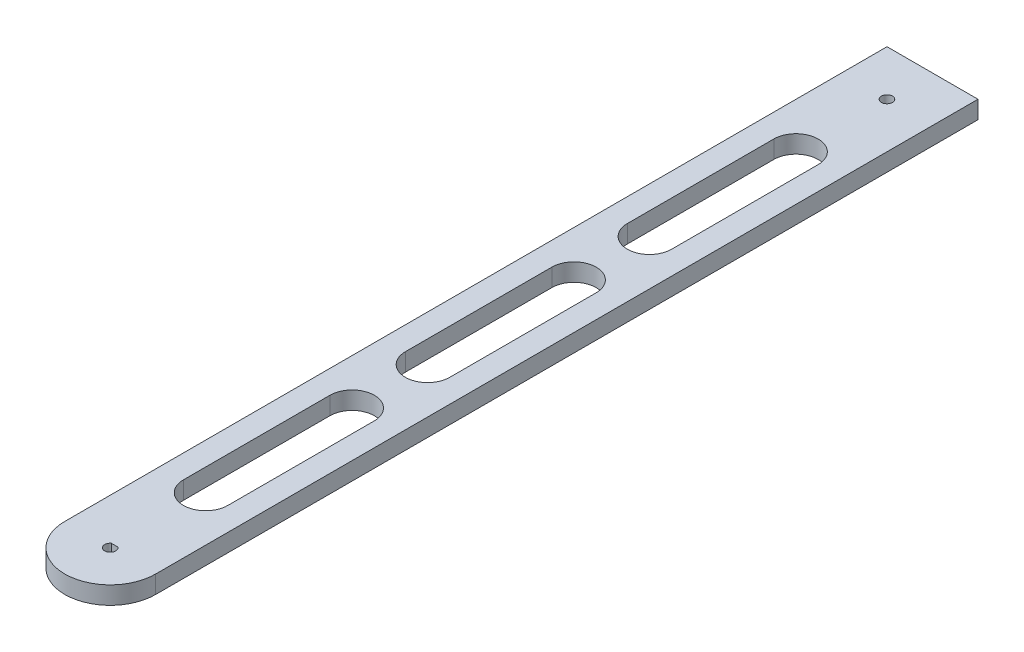
ISO-10303-21;
HEADER;
FILE_DESCRIPTION(('STEP AP214'),'2;1');
FILE_NAME('part.step','',(''),(''),'','','');
FILE_SCHEMA(('AUTOMOTIVE_DESIGN { 1 0 10303 214 1 1 1 1 }'));
ENDSEC;
DATA;
#1=APPLICATION_CONTEXT('core data for automotive mechanical design processes');
#2=APPLICATION_PROTOCOL_DEFINITION('international standard','automotive_design',2000,#1);
#3=PRODUCT_CONTEXT('',#1,'mechanical');
#4=PRODUCT('Part','Part','',(#3));
#5=PRODUCT_RELATED_PRODUCT_CATEGORY('part','',(#4));
#6=PRODUCT_DEFINITION_FORMATION('','',#4);
#7=PRODUCT_DEFINITION_CONTEXT('part definition',#1,'design');
#8=PRODUCT_DEFINITION('design','',#6,#7);
#9=PRODUCT_DEFINITION_SHAPE('','',#8);
#10=(LENGTH_UNIT() NAMED_UNIT(*) SI_UNIT(.MILLI.,.METRE.));
#11=(NAMED_UNIT(*) PLANE_ANGLE_UNIT() SI_UNIT($,.RADIAN.));
#12=(NAMED_UNIT(*) SI_UNIT($,.STERADIAN.) SOLID_ANGLE_UNIT());
#13=UNCERTAINTY_MEASURE_WITH_UNIT(LENGTH_MEASURE(1.E-05),#10,'distance_accuracy_value','');
#14=(GEOMETRIC_REPRESENTATION_CONTEXT(3) GLOBAL_UNCERTAINTY_ASSIGNED_CONTEXT((#13)) GLOBAL_UNIT_ASSIGNED_CONTEXT((#10,
#11,#12)) REPRESENTATION_CONTEXT('',''));
#15=CARTESIAN_POINT('',(0.,0.,0.));
#16=DIRECTION('',(0.,0.,1.));
#17=DIRECTION('',(1.,0.,0.));
#18=AXIS2_PLACEMENT_3D('',#15,#16,#17);
#19=CARTESIAN_POINT('',(0.,29.1,-21.6));
#20=DIRECTION('',(0.,1.,0.));
#21=DIRECTION('',(0.,0.,1.));
#22=AXIS2_PLACEMENT_3D('',#19,#20,#21);
#23=PLANE('',#22);
#24=CARTESIAN_POINT('',(0.,29.1,-371.6));
#25=DIRECTION('',(0.,1.,0.));
#26=DIRECTION('',(0.,0.,1.));
#27=AXIS2_PLACEMENT_3D('',#24,#25,#26);
#28=CIRCLE('',#27,2.5);
#29=CARTESIAN_POINT('',(0.,29.1,-369.1));
#30=VERTEX_POINT('',#29);
#31=EDGE_CURVE('E202',#30,#30,#28,.F.);
#32=ORIENTED_EDGE('',*,*,#31,.T.);
#33=EDGE_LOOP('',(#32));
#34=FACE_BOUND('',#33,.T.);
#35=DIRECTION('',(-1.,0.,0.));
#36=VECTOR('',#35,1.);
#37=CARTESIAN_POINT('',(-20.5,29.1,-392.131331168693));
#38=LINE('',#37,#36);
#39=CARTESIAN_POINT('',(20.5,29.1,-392.131331168693));
#40=VERTEX_POINT('',#39);
#41=CARTESIAN_POINT('',(-20.5,29.1,-392.131331168693));
#42=VERTEX_POINT('',#41);
#43=EDGE_CURVE('E163',#40,#42,#38,.T.);
#44=ORIENTED_EDGE('',*,*,#43,.T.);
#45=DIRECTION('',(0.,0.,1.));
#46=VECTOR('',#45,1.);
#47=CARTESIAN_POINT('',(-20.5,29.1,-21.6));
#48=LINE('',#47,#46);
#49=CARTESIAN_POINT('',(-20.5,29.1,-21.6));
#50=VERTEX_POINT('',#49);
#51=EDGE_CURVE('E168',#42,#50,#48,.T.);
#52=ORIENTED_EDGE('',*,*,#51,.T.);
#53=CARTESIAN_POINT('',(0.,29.1,-21.6));
#54=DIRECTION('',(0.,1.,0.));
#55=DIRECTION('',(0.,0.,1.));
#56=AXIS2_PLACEMENT_3D('',#53,#54,#55);
#57=CIRCLE('',#56,20.5);
#58=CARTESIAN_POINT('',(20.5,29.1,-21.6));
#59=VERTEX_POINT('',#58);
#60=EDGE_CURVE('E165',#50,#59,#57,.T.);
#61=ORIENTED_EDGE('',*,*,#60,.T.);
#62=DIRECTION('',(0.,0.,-1.));
#63=VECTOR('',#62,1.);
#64=CARTESIAN_POINT('',(20.5,29.1,-21.6));
#65=LINE('',#64,#63);
#66=EDGE_CURVE('E159',#59,#40,#65,.T.);
#67=ORIENTED_EDGE('',*,*,#66,.T.);
#68=EDGE_LOOP('',(#44,#52,#61,#67));
#69=FACE_BOUND('',#68,.T.);
#70=CARTESIAN_POINT('',(0.,29.1,-21.6));
#71=DIRECTION('',(0.,1.,0.));
#72=DIRECTION('',(0.,0.,1.));
#73=AXIS2_PLACEMENT_3D('',#70,#71,#72);
#74=CIRCLE('',#73,2.5);
#75=CARTESIAN_POINT('',(-1.5,29.1,-23.6));
#76=VERTEX_POINT('',#75);
#77=CARTESIAN_POINT('',(1.5,29.1,-23.6));
#78=VERTEX_POINT('',#77);
#79=EDGE_CURVE('E190',#76,#78,#74,.T.);
#80=ORIENTED_EDGE('',*,*,#79,.F.);
#81=DIRECTION('',(1.,0.,0.));
#82=VECTOR('',#81,1.);
#83=CARTESIAN_POINT('',(0.,29.1,-23.6));
#84=LINE('',#83,#82);
#85=EDGE_CURVE('E48',#76,#78,#84,.T.);
#86=ORIENTED_EDGE('',*,*,#85,.T.);
#87=EDGE_LOOP('',(#80,#86));
#88=FACE_BOUND('',#87,.T.);
#89=DIRECTION('',(0.,0.,1.));
#90=VECTOR('',#89,1.);
#91=CARTESIAN_POINT('',(-9.99999999999999,29.1,-330.6));
#92=LINE('',#91,#90);
#93=CARTESIAN_POINT('',(-9.99999999999999,29.1,-330.6));
#94=VERTEX_POINT('',#93);
#95=CARTESIAN_POINT('',(-9.99999999999998,29.1,-264.6));
#96=VERTEX_POINT('',#95);
#97=EDGE_CURVE('E269',#94,#96,#92,.T.);
#98=ORIENTED_EDGE('',*,*,#97,.F.);
#99=CARTESIAN_POINT('',(0.,29.1,-330.6));
#100=DIRECTION('',(0.,1.,0.));
#101=DIRECTION('',(0.,0.,1.));
#102=AXIS2_PLACEMENT_3D('',#99,#100,#101);
#103=CIRCLE('',#102,10.);
#104=CARTESIAN_POINT('',(10.,29.1,-330.6));
#105=VERTEX_POINT('',#104);
#106=EDGE_CURVE('E267',#105,#94,#103,.T.);
#107=ORIENTED_EDGE('',*,*,#106,.F.);
#108=DIRECTION('',(0.,0.,-1.));
#109=VECTOR('',#108,1.);
#110=CARTESIAN_POINT('',(10.,29.1,-330.6));
#111=LINE('',#110,#109);
#112=CARTESIAN_POINT('',(10.,29.1,-264.6));
#113=VERTEX_POINT('',#112);
#114=EDGE_CURVE('E275',#113,#105,#111,.T.);
#115=ORIENTED_EDGE('',*,*,#114,.F.);
#116=CARTESIAN_POINT('',(0.,29.1,-264.6));
#117=DIRECTION('',(0.,1.,0.));
#118=DIRECTION('',(0.,0.,1.));
#119=AXIS2_PLACEMENT_3D('',#116,#117,#118);
#120=CIRCLE('',#119,10.);
#121=EDGE_CURVE('E272',#96,#113,#120,.T.);
#122=ORIENTED_EDGE('',*,*,#121,.F.);
#123=EDGE_LOOP('',(#98,#107,#115,#122));
#124=FACE_BOUND('',#123,.T.);
#125=DIRECTION('',(0.,0.,1.));
#126=VECTOR('',#125,1.);
#127=CARTESIAN_POINT('',(-9.99999999999895,29.1,-230.6));
#128=LINE('',#127,#126);
#129=CARTESIAN_POINT('',(-9.99999999999895,29.1,-230.6));
#130=VERTEX_POINT('',#129);
#131=CARTESIAN_POINT('',(-9.99999999999894,29.1,-164.6));
#132=VERTEX_POINT('',#131);
#133=EDGE_CURVE('E238',#130,#132,#128,.T.);
#134=ORIENTED_EDGE('',*,*,#133,.F.);
#135=CARTESIAN_POINT('',(1.05178573957986E-12,29.1,-230.6));
#136=DIRECTION('',(0.,1.,0.));
#137=DIRECTION('',(0.,0.,1.));
#138=AXIS2_PLACEMENT_3D('',#135,#136,#137);
#139=CIRCLE('',#138,10.);
#140=CARTESIAN_POINT('',(10.0000000000011,29.1,-230.6));
#141=VERTEX_POINT('',#140);
#142=EDGE_CURVE('E236',#141,#130,#139,.T.);
#143=ORIENTED_EDGE('',*,*,#142,.F.);
#144=DIRECTION('',(0.,0.,-1.));
#145=VECTOR('',#144,1.);
#146=CARTESIAN_POINT('',(10.0000000000011,29.1,-230.6));
#147=LINE('',#146,#145);
#148=CARTESIAN_POINT('',(10.0000000000011,29.1,-164.6));
#149=VERTEX_POINT('',#148);
#150=EDGE_CURVE('E244',#149,#141,#147,.T.);
#151=ORIENTED_EDGE('',*,*,#150,.F.);
#152=CARTESIAN_POINT('',(1.05986840845423E-12,29.1,-164.6));
#153=DIRECTION('',(0.,1.,0.));
#154=DIRECTION('',(0.,0.,1.));
#155=AXIS2_PLACEMENT_3D('',#152,#153,#154);
#156=CIRCLE('',#155,10.);
#157=EDGE_CURVE('E241',#132,#149,#156,.T.);
#158=ORIENTED_EDGE('',*,*,#157,.F.);
#159=EDGE_LOOP('',(#134,#143,#151,#158));
#160=FACE_BOUND('',#159,.T.);
#161=DIRECTION('',(0.,0.,1.));
#162=VECTOR('',#161,1.);
#163=CARTESIAN_POINT('',(-9.99999999999791,29.1,-130.6));
#164=LINE('',#163,#162);
#165=CARTESIAN_POINT('',(-9.99999999999791,29.1,-130.6));
#166=VERTEX_POINT('',#165);
#167=CARTESIAN_POINT('',(-9.9999999999979,29.1,-64.6));
#168=VERTEX_POINT('',#167);
#169=EDGE_CURVE('E207',#166,#168,#164,.T.);
#170=ORIENTED_EDGE('',*,*,#169,.F.);
#171=CARTESIAN_POINT('',(2.09310690723706E-12,29.1,-130.6));
#172=DIRECTION('',(0.,1.,0.));
#173=DIRECTION('',(0.,0.,1.));
#174=AXIS2_PLACEMENT_3D('',#171,#172,#173);
#175=CIRCLE('',#174,10.);
#176=CARTESIAN_POINT('',(10.0000000000021,29.1,-130.6));
#177=VERTEX_POINT('',#176);
#178=EDGE_CURVE('E205',#177,#166,#175,.T.);
#179=ORIENTED_EDGE('',*,*,#178,.F.);
#180=DIRECTION('',(0.,0.,-1.));
#181=VECTOR('',#180,1.);
#182=CARTESIAN_POINT('',(10.0000000000021,29.1,-130.6));
#183=LINE('',#182,#181);
#184=CARTESIAN_POINT('',(10.0000000000021,29.1,-64.6));
#185=VERTEX_POINT('',#184);
#186=EDGE_CURVE('E213',#185,#177,#183,.T.);
#187=ORIENTED_EDGE('',*,*,#186,.F.);
#188=CARTESIAN_POINT('',(2.10118957611144E-12,29.1,-64.6));
#189=DIRECTION('',(0.,1.,0.));
#190=DIRECTION('',(0.,0.,1.));
#191=AXIS2_PLACEMENT_3D('',#188,#189,#190);
#192=CIRCLE('',#191,10.);
#193=EDGE_CURVE('E210',#168,#185,#192,.T.);
#194=ORIENTED_EDGE('',*,*,#193,.F.);
#195=EDGE_LOOP('',(#170,#179,#187,#194));
#196=FACE_BOUND('',#195,.T.);
#197=ADVANCED_FACE('F33',(#34,#69,#88,#124,#160,#196),#23,.T.);
#198=CARTESIAN_POINT('',(0.,21.1,-21.6));
#199=DIRECTION('',(0.,1.,0.));
#200=DIRECTION('',(0.,0.,1.));
#201=AXIS2_PLACEMENT_3D('',#198,#199,#200);
#202=PLANE('',#201);
#203=CARTESIAN_POINT('',(0.,21.1,-371.6));
#204=DIRECTION('',(0.,1.,0.));
#205=DIRECTION('',(0.,0.,1.));
#206=AXIS2_PLACEMENT_3D('',#203,#204,#205);
#207=CIRCLE('',#206,2.5);
#208=CARTESIAN_POINT('',(0.,21.1,-369.1));
#209=VERTEX_POINT('',#208);
#210=EDGE_CURVE('E195',#209,#209,#207,.F.);
#211=ORIENTED_EDGE('',*,*,#210,.F.);
#212=EDGE_LOOP('',(#211));
#213=FACE_BOUND('',#212,.T.);
#214=DIRECTION('',(1.,0.,0.));
#215=VECTOR('',#214,1.);
#216=CARTESIAN_POINT('',(0.,21.1,-23.6));
#217=LINE('',#216,#215);
#218=CARTESIAN_POINT('',(-1.5,21.1,-23.6));
#219=VERTEX_POINT('',#218);
#220=CARTESIAN_POINT('',(1.5,21.1,-23.6));
#221=VERTEX_POINT('',#220);
#222=EDGE_CURVE('E187',#219,#221,#217,.T.);
#223=ORIENTED_EDGE('',*,*,#222,.F.);
#224=CARTESIAN_POINT('',(0.,21.1,-21.6));
#225=DIRECTION('',(0.,1.,0.));
#226=DIRECTION('',(0.,0.,1.));
#227=AXIS2_PLACEMENT_3D('',#224,#225,#226);
#228=CIRCLE('',#227,2.5);
#229=EDGE_CURVE('E189',#219,#221,#228,.T.);
#230=ORIENTED_EDGE('',*,*,#229,.T.);
#231=EDGE_LOOP('',(#223,#230));
#232=FACE_BOUND('',#231,.T.);
#233=DIRECTION('',(0.,0.,1.));
#234=VECTOR('',#233,1.);
#235=CARTESIAN_POINT('',(-20.5,21.1,-21.6));
#236=LINE('',#235,#234);
#237=CARTESIAN_POINT('',(-20.5,21.1,-392.131331168693));
#238=VERTEX_POINT('',#237);
#239=CARTESIAN_POINT('',(-20.5,21.1,-21.6));
#240=VERTEX_POINT('',#239);
#241=EDGE_CURVE('E298',#238,#240,#236,.T.);
#242=ORIENTED_EDGE('',*,*,#241,.F.);
#243=DIRECTION('',(1.,0.,0.));
#244=VECTOR('',#243,1.);
#245=CARTESIAN_POINT('',(-20.5,21.1,-392.131331168693));
#246=LINE('',#245,#244);
#247=CARTESIAN_POINT('',(20.5,21.1,-392.131331168693));
#248=VERTEX_POINT('',#247);
#249=EDGE_CURVE('E185',#238,#248,#246,.T.);
#250=ORIENTED_EDGE('',*,*,#249,.T.);
#251=DIRECTION('',(0.,0.,-1.));
#252=VECTOR('',#251,1.);
#253=CARTESIAN_POINT('',(20.5,21.1,-21.6));
#254=LINE('',#253,#252);
#255=CARTESIAN_POINT('',(20.5,21.1,-21.6));
#256=VERTEX_POINT('',#255);
#257=EDGE_CURVE('E173',#256,#248,#254,.T.);
#258=ORIENTED_EDGE('',*,*,#257,.F.);
#259=CARTESIAN_POINT('',(0.,21.1,-21.6));
#260=DIRECTION('',(0.,1.,0.));
#261=DIRECTION('',(0.,0.,1.));
#262=AXIS2_PLACEMENT_3D('',#259,#260,#261);
#263=CIRCLE('',#262,20.5);
#264=EDGE_CURVE('E297',#240,#256,#263,.T.);
#265=ORIENTED_EDGE('',*,*,#264,.F.);
#266=EDGE_LOOP('',(#242,#250,#258,#265));
#267=FACE_BOUND('',#266,.T.);
#268=CARTESIAN_POINT('',(1.05178573957986E-12,21.1,-230.6));
#269=DIRECTION('',(0.,1.,0.));
#270=DIRECTION('',(0.,0.,1.));
#271=AXIS2_PLACEMENT_3D('',#268,#269,#270);
#272=CIRCLE('',#271,10.);
#273=CARTESIAN_POINT('',(10.0000000000011,21.1,-230.6));
#274=VERTEX_POINT('',#273);
#275=CARTESIAN_POINT('',(-9.99999999999895,21.1,-230.6));
#276=VERTEX_POINT('',#275);
#277=EDGE_CURVE('E235',#274,#276,#272,.T.);
#278=ORIENTED_EDGE('',*,*,#277,.T.);
#279=DIRECTION('',(0.,0.,1.));
#280=VECTOR('',#279,1.);
#281=CARTESIAN_POINT('',(-9.99999999999895,21.1,-230.6));
#282=LINE('',#281,#280);
#283=CARTESIAN_POINT('',(-9.99999999999894,21.1,-164.6));
#284=VERTEX_POINT('',#283);
#285=EDGE_CURVE('E249',#276,#284,#282,.T.);
#286=ORIENTED_EDGE('',*,*,#285,.T.);
#287=CARTESIAN_POINT('',(1.05986840845423E-12,21.1,-164.6));
#288=DIRECTION('',(0.,1.,0.));
#289=DIRECTION('',(0.,0.,1.));
#290=AXIS2_PLACEMENT_3D('',#287,#288,#289);
#291=CIRCLE('',#290,10.);
#292=CARTESIAN_POINT('',(10.0000000000011,21.1,-164.6));
#293=VERTEX_POINT('',#292);
#294=EDGE_CURVE('E252',#284,#293,#291,.T.);
#295=ORIENTED_EDGE('',*,*,#294,.T.);
#296=DIRECTION('',(0.,0.,-1.));
#297=VECTOR('',#296,1.);
#298=CARTESIAN_POINT('',(10.0000000000011,21.1,-230.6));
#299=LINE('',#298,#297);
#300=EDGE_CURVE('E239',#293,#274,#299,.T.);
#301=ORIENTED_EDGE('',*,*,#300,.T.);
#302=EDGE_LOOP('',(#278,#286,#295,#301));
#303=FACE_BOUND('',#302,.T.);
#304=CARTESIAN_POINT('',(0.,21.1,-330.6));
#305=DIRECTION('',(0.,1.,0.));
#306=DIRECTION('',(0.,0.,1.));
#307=AXIS2_PLACEMENT_3D('',#304,#305,#306);
#308=CIRCLE('',#307,10.);
#309=CARTESIAN_POINT('',(10.,21.1,-330.6));
#310=VERTEX_POINT('',#309);
#311=CARTESIAN_POINT('',(-9.99999999999999,21.1,-330.6));
#312=VERTEX_POINT('',#311);
#313=EDGE_CURVE('E266',#310,#312,#308,.T.);
#314=ORIENTED_EDGE('',*,*,#313,.T.);
#315=DIRECTION('',(0.,0.,1.));
#316=VECTOR('',#315,1.);
#317=CARTESIAN_POINT('',(-9.99999999999999,21.1,-330.6));
#318=LINE('',#317,#316);
#319=CARTESIAN_POINT('',(-9.99999999999998,21.1,-264.6));
#320=VERTEX_POINT('',#319);
#321=EDGE_CURVE('E280',#312,#320,#318,.T.);
#322=ORIENTED_EDGE('',*,*,#321,.T.);
#323=CARTESIAN_POINT('',(0.,21.1,-264.6));
#324=DIRECTION('',(0.,1.,0.));
#325=DIRECTION('',(0.,0.,1.));
#326=AXIS2_PLACEMENT_3D('',#323,#324,#325);
#327=CIRCLE('',#326,10.);
#328=CARTESIAN_POINT('',(10.,21.1,-264.6));
#329=VERTEX_POINT('',#328);
#330=EDGE_CURVE('E283',#320,#329,#327,.T.);
#331=ORIENTED_EDGE('',*,*,#330,.T.);
#332=DIRECTION('',(0.,0.,-1.));
#333=VECTOR('',#332,1.);
#334=CARTESIAN_POINT('',(10.,21.1,-330.6));
#335=LINE('',#334,#333);
#336=EDGE_CURVE('E270',#329,#310,#335,.T.);
#337=ORIENTED_EDGE('',*,*,#336,.T.);
#338=EDGE_LOOP('',(#314,#322,#331,#337));
#339=FACE_BOUND('',#338,.T.);
#340=CARTESIAN_POINT('',(2.09310690723706E-12,21.1,-130.6));
#341=DIRECTION('',(0.,1.,0.));
#342=DIRECTION('',(0.,0.,1.));
#343=AXIS2_PLACEMENT_3D('',#340,#341,#342);
#344=CIRCLE('',#343,10.);
#345=CARTESIAN_POINT('',(10.0000000000021,21.1,-130.6));
#346=VERTEX_POINT('',#345);
#347=CARTESIAN_POINT('',(-9.99999999999791,21.1,-130.6));
#348=VERTEX_POINT('',#347);
#349=EDGE_CURVE('E198',#346,#348,#344,.T.);
#350=ORIENTED_EDGE('',*,*,#349,.T.);
#351=DIRECTION('',(0.,0.,1.));
#352=VECTOR('',#351,1.);
#353=CARTESIAN_POINT('',(-9.99999999999791,21.1,-130.6));
#354=LINE('',#353,#352);
#355=CARTESIAN_POINT('',(-9.9999999999979,21.1,-64.6));
#356=VERTEX_POINT('',#355);
#357=EDGE_CURVE('E218',#348,#356,#354,.T.);
#358=ORIENTED_EDGE('',*,*,#357,.T.);
#359=CARTESIAN_POINT('',(2.10118957611144E-12,21.1,-64.6));
#360=DIRECTION('',(0.,1.,0.));
#361=DIRECTION('',(0.,0.,1.));
#362=AXIS2_PLACEMENT_3D('',#359,#360,#361);
#363=CIRCLE('',#362,10.);
#364=CARTESIAN_POINT('',(10.0000000000021,21.1,-64.6));
#365=VERTEX_POINT('',#364);
#366=EDGE_CURVE('E221',#356,#365,#363,.T.);
#367=ORIENTED_EDGE('',*,*,#366,.T.);
#368=DIRECTION('',(0.,0.,-1.));
#369=VECTOR('',#368,1.);
#370=CARTESIAN_POINT('',(10.0000000000021,21.1,-130.6));
#371=LINE('',#370,#369);
#372=EDGE_CURVE('E208',#365,#346,#371,.T.);
#373=ORIENTED_EDGE('',*,*,#372,.T.);
#374=EDGE_LOOP('',(#350,#358,#367,#373));
#375=FACE_BOUND('',#374,.T.);
#376=ADVANCED_FACE('F310',(#213,#232,#267,#303,#339,#375),#202,.F.);
#377=CARTESIAN_POINT('',(0.,29.1,-21.6));
#378=DIRECTION('',(0.,-1.,0.));
#379=DIRECTION('',(0.,0.,-1.));
#380=AXIS2_PLACEMENT_3D('',#377,#378,#379);
#381=CYLINDRICAL_SURFACE('',#380,20.5);
#382=ORIENTED_EDGE('',*,*,#264,.T.);
#383=DIRECTION('',(0.,-1.,0.));
#384=VECTOR('',#383,1.);
#385=CARTESIAN_POINT('',(20.5,29.1,-21.6));
#386=LINE('',#385,#384);
#387=EDGE_CURVE('E11',#59,#256,#386,.T.);
#388=ORIENTED_EDGE('',*,*,#387,.F.);
#389=ORIENTED_EDGE('',*,*,#60,.F.);
#390=DIRECTION('',(0.,-1.,0.));
#391=VECTOR('',#390,1.);
#392=CARTESIAN_POINT('',(-20.5,29.1,-21.6));
#393=LINE('',#392,#391);
#394=EDGE_CURVE('E41',#50,#240,#393,.T.);
#395=ORIENTED_EDGE('',*,*,#394,.T.);
#396=EDGE_LOOP('',(#382,#388,#389,#395));
#397=FACE_BOUND('',#396,.T.);
#398=ADVANCED_FACE('F35',(#397),#381,.T.);
#399=CARTESIAN_POINT('',(20.5,29.1,-21.6));
#400=DIRECTION('',(-1.,0.,0.));
#401=DIRECTION('',(0.,0.,1.));
#402=AXIS2_PLACEMENT_3D('',#399,#400,#401);
#403=PLANE('',#402);
#404=ORIENTED_EDGE('',*,*,#257,.T.);
#405=DIRECTION('',(0.,1.,0.));
#406=VECTOR('',#405,1.);
#407=CARTESIAN_POINT('',(20.5,-24.7534138266559,-392.131331168693));
#408=LINE('',#407,#406);
#409=EDGE_CURVE('E171',#248,#40,#408,.T.);
#410=ORIENTED_EDGE('',*,*,#409,.T.);
#411=ORIENTED_EDGE('',*,*,#66,.F.);
#412=ORIENTED_EDGE('',*,*,#387,.T.);
#413=EDGE_LOOP('',(#404,#410,#411,#412));
#414=FACE_BOUND('',#413,.T.);
#415=ADVANCED_FACE('F172',(#414),#403,.F.);
#416=CARTESIAN_POINT('',(-20.5,29.1,-21.6));
#417=DIRECTION('',(1.,0.,0.));
#418=DIRECTION('',(0.,0.,-1.));
#419=AXIS2_PLACEMENT_3D('',#416,#417,#418);
#420=PLANE('',#419);
#421=ORIENTED_EDGE('',*,*,#241,.T.);
#422=ORIENTED_EDGE('',*,*,#394,.F.);
#423=ORIENTED_EDGE('',*,*,#51,.F.);
#424=DIRECTION('',(0.,1.,0.));
#425=VECTOR('',#424,1.);
#426=CARTESIAN_POINT('',(-20.5,-24.7534138266559,-392.131331168693));
#427=LINE('',#426,#425);
#428=EDGE_CURVE('E177',#238,#42,#427,.T.);
#429=ORIENTED_EDGE('',*,*,#428,.F.);
#430=EDGE_LOOP('',(#421,#422,#423,#429));
#431=FACE_BOUND('',#430,.T.);
#432=ADVANCED_FACE('F312',(#431),#420,.F.);
#433=CARTESIAN_POINT('',(0.,29.1,-330.6));
#434=DIRECTION('',(0.,-1.,0.));
#435=DIRECTION('',(0.,0.,-1.));
#436=AXIS2_PLACEMENT_3D('',#433,#434,#435);
#437=CYLINDRICAL_SURFACE('',#436,10.);
#438=ORIENTED_EDGE('',*,*,#313,.F.);
#439=DIRECTION('',(0.,-1.,0.));
#440=VECTOR('',#439,1.);
#441=CARTESIAN_POINT('',(10.,29.1,-330.6));
#442=LINE('',#441,#440);
#443=EDGE_CURVE('E277',#105,#310,#442,.T.);
#444=ORIENTED_EDGE('',*,*,#443,.F.);
#445=ORIENTED_EDGE('',*,*,#106,.T.);
#446=DIRECTION('',(0.,-1.,0.));
#447=VECTOR('',#446,1.);
#448=CARTESIAN_POINT('',(-9.99999999999999,29.1,-330.6));
#449=LINE('',#448,#447);
#450=EDGE_CURVE('E294',#94,#312,#449,.T.);
#451=ORIENTED_EDGE('',*,*,#450,.T.);
#452=EDGE_LOOP('',(#438,#444,#445,#451));
#453=FACE_BOUND('',#452,.T.);
#454=ADVANCED_FACE('F314',(#453),#437,.F.);
#455=CARTESIAN_POINT('',(-9.99999999999999,29.1,-330.6));
#456=DIRECTION('',(1.,0.,0.));
#457=DIRECTION('',(0.,0.,-1.));
#458=AXIS2_PLACEMENT_3D('',#455,#456,#457);
#459=PLANE('',#458);
#460=ORIENTED_EDGE('',*,*,#321,.F.);
#461=ORIENTED_EDGE('',*,*,#450,.F.);
#462=ORIENTED_EDGE('',*,*,#97,.T.);
#463=DIRECTION('',(0.,-1.,0.));
#464=VECTOR('',#463,1.);
#465=CARTESIAN_POINT('',(-9.99999999999998,29.1,-264.6));
#466=LINE('',#465,#464);
#467=EDGE_CURVE('E292',#96,#320,#466,.T.);
#468=ORIENTED_EDGE('',*,*,#467,.T.);
#469=EDGE_LOOP('',(#460,#461,#462,#468));
#470=FACE_BOUND('',#469,.T.);
#471=ADVANCED_FACE('F320',(#470),#459,.T.);
#472=CARTESIAN_POINT('',(0.,29.1,-264.6));
#473=DIRECTION('',(0.,-1.,0.));
#474=DIRECTION('',(0.,0.,-1.));
#475=AXIS2_PLACEMENT_3D('',#472,#473,#474);
#476=CYLINDRICAL_SURFACE('',#475,10.);
#477=ORIENTED_EDGE('',*,*,#330,.F.);
#478=ORIENTED_EDGE('',*,*,#467,.F.);
#479=ORIENTED_EDGE('',*,*,#121,.T.);
#480=DIRECTION('',(0.,-1.,0.));
#481=VECTOR('',#480,1.);
#482=CARTESIAN_POINT('',(10.,29.1,-264.6));
#483=LINE('',#482,#481);
#484=EDGE_CURVE('E290',#113,#329,#483,.T.);
#485=ORIENTED_EDGE('',*,*,#484,.T.);
#486=EDGE_LOOP('',(#477,#478,#479,#485));
#487=FACE_BOUND('',#486,.T.);
#488=ADVANCED_FACE('F334',(#487),#476,.F.);
#489=CARTESIAN_POINT('',(10.,29.1,-330.6));
#490=DIRECTION('',(-1.,0.,0.));
#491=DIRECTION('',(0.,0.,1.));
#492=AXIS2_PLACEMENT_3D('',#489,#490,#491);
#493=PLANE('',#492);
#494=ORIENTED_EDGE('',*,*,#336,.F.);
#495=ORIENTED_EDGE('',*,*,#484,.F.);
#496=ORIENTED_EDGE('',*,*,#114,.T.);
#497=ORIENTED_EDGE('',*,*,#443,.T.);
#498=EDGE_LOOP('',(#494,#495,#496,#497));
#499=FACE_BOUND('',#498,.T.);
#500=ADVANCED_FACE('F338',(#499),#493,.T.);
#501=CARTESIAN_POINT('',(1.05178573957986E-12,29.1,-230.6));
#502=DIRECTION('',(0.,-1.,0.));
#503=DIRECTION('',(0.,0.,-1.));
#504=AXIS2_PLACEMENT_3D('',#501,#502,#503);
#505=CYLINDRICAL_SURFACE('',#504,10.);
#506=ORIENTED_EDGE('',*,*,#277,.F.);
#507=DIRECTION('',(0.,-1.,0.));
#508=VECTOR('',#507,1.);
#509=CARTESIAN_POINT('',(10.0000000000011,29.1,-230.6));
#510=LINE('',#509,#508);
#511=EDGE_CURVE('E246',#141,#274,#510,.T.);
#512=ORIENTED_EDGE('',*,*,#511,.F.);
#513=ORIENTED_EDGE('',*,*,#142,.T.);
#514=DIRECTION('',(0.,-1.,0.));
#515=VECTOR('',#514,1.);
#516=CARTESIAN_POINT('',(-9.99999999999895,29.1,-230.6));
#517=LINE('',#516,#515);
#518=EDGE_CURVE('E263',#130,#276,#517,.T.);
#519=ORIENTED_EDGE('',*,*,#518,.T.);
#520=EDGE_LOOP('',(#506,#512,#513,#519));
#521=FACE_BOUND('',#520,.T.);
#522=ADVANCED_FACE('F342',(#521),#505,.F.);
#523=CARTESIAN_POINT('',(-9.99999999999895,29.1,-230.6));
#524=DIRECTION('',(1.,0.,0.));
#525=DIRECTION('',(0.,0.,-1.));
#526=AXIS2_PLACEMENT_3D('',#523,#524,#525);
#527=PLANE('',#526);
#528=ORIENTED_EDGE('',*,*,#285,.F.);
#529=ORIENTED_EDGE('',*,*,#518,.F.);
#530=ORIENTED_EDGE('',*,*,#133,.T.);
#531=DIRECTION('',(0.,-1.,0.));
#532=VECTOR('',#531,1.);
#533=CARTESIAN_POINT('',(-9.99999999999894,29.1,-164.6));
#534=LINE('',#533,#532);
#535=EDGE_CURVE('E261',#132,#284,#534,.T.);
#536=ORIENTED_EDGE('',*,*,#535,.T.);
#537=EDGE_LOOP('',(#528,#529,#530,#536));
#538=FACE_BOUND('',#537,.T.);
#539=ADVANCED_FACE('F346',(#538),#527,.T.);
#540=CARTESIAN_POINT('',(1.05986840845423E-12,29.1,-164.6));
#541=DIRECTION('',(0.,-1.,0.));
#542=DIRECTION('',(0.,0.,-1.));
#543=AXIS2_PLACEMENT_3D('',#540,#541,#542);
#544=CYLINDRICAL_SURFACE('',#543,10.);
#545=ORIENTED_EDGE('',*,*,#294,.F.);
#546=ORIENTED_EDGE('',*,*,#535,.F.);
#547=ORIENTED_EDGE('',*,*,#157,.T.);
#548=DIRECTION('',(0.,-1.,0.));
#549=VECTOR('',#548,1.);
#550=CARTESIAN_POINT('',(10.0000000000011,29.1,-164.6));
#551=LINE('',#550,#549);
#552=EDGE_CURVE('E259',#149,#293,#551,.T.);
#553=ORIENTED_EDGE('',*,*,#552,.T.);
#554=EDGE_LOOP('',(#545,#546,#547,#553));
#555=FACE_BOUND('',#554,.T.);
#556=ADVANCED_FACE('F350',(#555),#544,.F.);
#557=CARTESIAN_POINT('',(10.0000000000011,29.1,-230.6));
#558=DIRECTION('',(-1.,0.,0.));
#559=DIRECTION('',(0.,0.,1.));
#560=AXIS2_PLACEMENT_3D('',#557,#558,#559);
#561=PLANE('',#560);
#562=ORIENTED_EDGE('',*,*,#300,.F.);
#563=ORIENTED_EDGE('',*,*,#552,.F.);
#564=ORIENTED_EDGE('',*,*,#150,.T.);
#565=ORIENTED_EDGE('',*,*,#511,.T.);
#566=EDGE_LOOP('',(#562,#563,#564,#565));
#567=FACE_BOUND('',#566,.T.);
#568=ADVANCED_FACE('F354',(#567),#561,.T.);
#569=CARTESIAN_POINT('',(2.09310690723706E-12,29.1,-130.6));
#570=DIRECTION('',(0.,-1.,0.));
#571=DIRECTION('',(0.,0.,-1.));
#572=AXIS2_PLACEMENT_3D('',#569,#570,#571);
#573=CYLINDRICAL_SURFACE('',#572,10.);
#574=ORIENTED_EDGE('',*,*,#349,.F.);
#575=DIRECTION('',(0.,-1.,0.));
#576=VECTOR('',#575,1.);
#577=CARTESIAN_POINT('',(10.0000000000021,29.1,-130.6));
#578=LINE('',#577,#576);
#579=EDGE_CURVE('E215',#177,#346,#578,.T.);
#580=ORIENTED_EDGE('',*,*,#579,.F.);
#581=ORIENTED_EDGE('',*,*,#178,.T.);
#582=DIRECTION('',(0.,-1.,0.));
#583=VECTOR('',#582,1.);
#584=CARTESIAN_POINT('',(-9.99999999999791,29.1,-130.6));
#585=LINE('',#584,#583);
#586=EDGE_CURVE('E232',#166,#348,#585,.T.);
#587=ORIENTED_EDGE('',*,*,#586,.T.);
#588=EDGE_LOOP('',(#574,#580,#581,#587));
#589=FACE_BOUND('',#588,.T.);
#590=ADVANCED_FACE('F358',(#589),#573,.F.);
#591=CARTESIAN_POINT('',(-9.99999999999791,29.1,-130.6));
#592=DIRECTION('',(1.,0.,0.));
#593=DIRECTION('',(0.,0.,-1.));
#594=AXIS2_PLACEMENT_3D('',#591,#592,#593);
#595=PLANE('',#594);
#596=ORIENTED_EDGE('',*,*,#357,.F.);
#597=ORIENTED_EDGE('',*,*,#586,.F.);
#598=ORIENTED_EDGE('',*,*,#169,.T.);
#599=DIRECTION('',(0.,-1.,0.));
#600=VECTOR('',#599,1.);
#601=CARTESIAN_POINT('',(-9.9999999999979,29.1,-64.6));
#602=LINE('',#601,#600);
#603=EDGE_CURVE('E230',#168,#356,#602,.T.);
#604=ORIENTED_EDGE('',*,*,#603,.T.);
#605=EDGE_LOOP('',(#596,#597,#598,#604));
#606=FACE_BOUND('',#605,.T.);
#607=ADVANCED_FACE('F362',(#606),#595,.T.);
#608=CARTESIAN_POINT('',(2.10118957611144E-12,29.1,-64.6));
#609=DIRECTION('',(0.,-1.,0.));
#610=DIRECTION('',(0.,0.,-1.));
#611=AXIS2_PLACEMENT_3D('',#608,#609,#610);
#612=CYLINDRICAL_SURFACE('',#611,10.);
#613=ORIENTED_EDGE('',*,*,#366,.F.);
#614=ORIENTED_EDGE('',*,*,#603,.F.);
#615=ORIENTED_EDGE('',*,*,#193,.T.);
#616=DIRECTION('',(0.,-1.,0.));
#617=VECTOR('',#616,1.);
#618=CARTESIAN_POINT('',(10.0000000000021,29.1,-64.6));
#619=LINE('',#618,#617);
#620=EDGE_CURVE('E228',#185,#365,#619,.T.);
#621=ORIENTED_EDGE('',*,*,#620,.T.);
#622=EDGE_LOOP('',(#613,#614,#615,#621));
#623=FACE_BOUND('',#622,.T.);
#624=ADVANCED_FACE('F366',(#623),#612,.F.);
#625=CARTESIAN_POINT('',(10.0000000000021,29.1,-130.6));
#626=DIRECTION('',(-1.,0.,0.));
#627=DIRECTION('',(0.,0.,1.));
#628=AXIS2_PLACEMENT_3D('',#625,#626,#627);
#629=PLANE('',#628);
#630=ORIENTED_EDGE('',*,*,#372,.F.);
#631=ORIENTED_EDGE('',*,*,#620,.F.);
#632=ORIENTED_EDGE('',*,*,#186,.T.);
#633=ORIENTED_EDGE('',*,*,#579,.T.);
#634=EDGE_LOOP('',(#630,#631,#632,#633));
#635=FACE_BOUND('',#634,.T.);
#636=ADVANCED_FACE('F370',(#635),#629,.T.);
#637=CARTESIAN_POINT('',(0.,21.1,-371.6));
#638=DIRECTION('',(0.,1.,0.));
#639=DIRECTION('',(0.,0.,1.));
#640=AXIS2_PLACEMENT_3D('',#637,#638,#639);
#641=CYLINDRICAL_SURFACE('',#640,2.5);
#642=ORIENTED_EDGE('',*,*,#210,.T.);
#643=EDGE_LOOP('',(#642));
#644=FACE_BOUND('',#643,.T.);
#645=ORIENTED_EDGE('',*,*,#31,.F.);
#646=EDGE_LOOP('',(#645));
#647=FACE_BOUND('',#646,.T.);
#648=ADVANCED_FACE('F374',(#644,#647),#641,.F.);
#649=CARTESIAN_POINT('',(0.,21.1,-23.6));
#650=DIRECTION('',(0.,0.,1.));
#651=DIRECTION('',(1.,0.,0.));
#652=AXIS2_PLACEMENT_3D('',#649,#650,#651);
#653=PLANE('',#652);
#654=ORIENTED_EDGE('',*,*,#85,.F.);
#655=DIRECTION('',(0.,1.,0.));
#656=VECTOR('',#655,1.);
#657=CARTESIAN_POINT('',(-1.5,21.1,-23.6));
#658=LINE('',#657,#656);
#659=EDGE_CURVE('E193',#219,#76,#658,.T.);
#660=ORIENTED_EDGE('',*,*,#659,.F.);
#661=ORIENTED_EDGE('',*,*,#222,.T.);
#662=DIRECTION('',(0.,1.,0.));
#663=VECTOR('',#662,1.);
#664=CARTESIAN_POINT('',(1.5,21.1,-23.6));
#665=LINE('',#664,#663);
#666=EDGE_CURVE('E55',#221,#78,#665,.T.);
#667=ORIENTED_EDGE('',*,*,#666,.T.);
#668=EDGE_LOOP('',(#654,#660,#661,#667));
#669=FACE_BOUND('',#668,.T.);
#670=ADVANCED_FACE('F378',(#669),#653,.T.);
#671=CARTESIAN_POINT('',(0.,21.1,-21.6));
#672=DIRECTION('',(0.,1.,0.));
#673=DIRECTION('',(0.,0.,1.));
#674=AXIS2_PLACEMENT_3D('',#671,#672,#673);
#675=CYLINDRICAL_SURFACE('',#674,2.5);
#676=ORIENTED_EDGE('',*,*,#79,.T.);
#677=ORIENTED_EDGE('',*,*,#666,.F.);
#678=ORIENTED_EDGE('',*,*,#229,.F.);
#679=ORIENTED_EDGE('',*,*,#659,.T.);
#680=EDGE_LOOP('',(#676,#677,#678,#679));
#681=FACE_BOUND('',#680,.T.);
#682=ADVANCED_FACE('F382',(#681),#675,.F.);
#683=CARTESIAN_POINT('',(-20.5,-24.7534138266559,-392.131331168693));
#684=DIRECTION('',(0.,0.,-1.));
#685=DIRECTION('',(-1.,0.,0.));
#686=AXIS2_PLACEMENT_3D('',#683,#684,#685);
#687=PLANE('',#686);
#688=ORIENTED_EDGE('',*,*,#249,.F.);
#689=ORIENTED_EDGE('',*,*,#428,.T.);
#690=ORIENTED_EDGE('',*,*,#43,.F.);
#691=ORIENTED_EDGE('',*,*,#409,.F.);
#692=EDGE_LOOP('',(#688,#689,#690,#691));
#693=FACE_BOUND('',#692,.T.);
#694=ADVANCED_FACE('F180',(#693),#687,.T.);
#695=CLOSED_SHELL('',(#197,#376,#398,#415,#432,#454,#471,#488,#500,#522,#539,#556,#568,#590,
#607,#624,#636,#648,#670,#682,#694));
#696=MANIFOLD_SOLID_BREP('B2',#695);
#697=ADVANCED_BREP_SHAPE_REPRESENTATION('',(#18,#696),#14);
#698=SHAPE_DEFINITION_REPRESENTATION(#9,#697);
ENDSEC;
END-ISO-10303-21;
